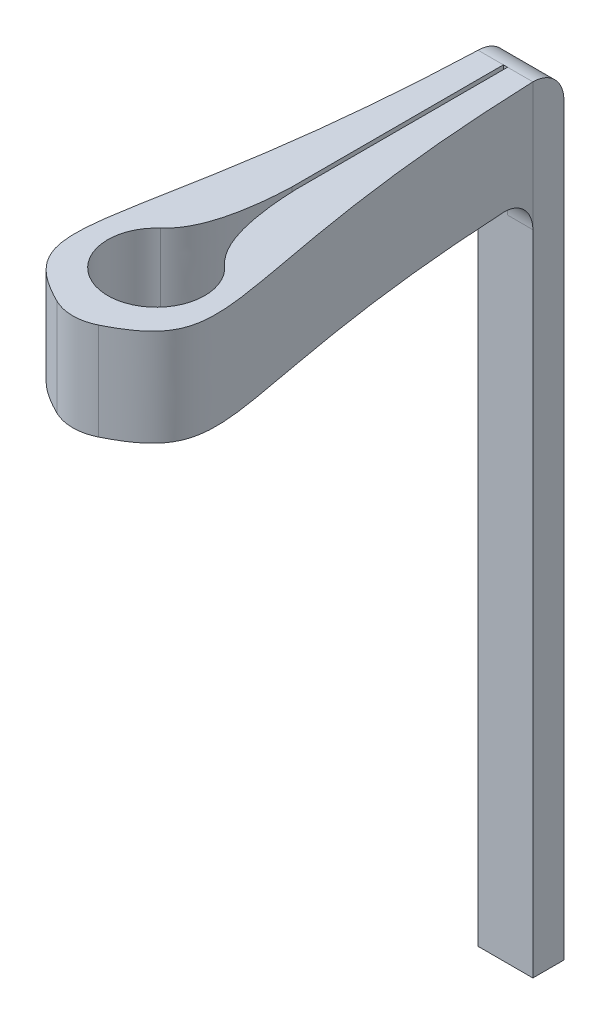
ISO-10303-21;
HEADER;
FILE_DESCRIPTION(('STEP AP214'),'2;1');
FILE_NAME('part.step','',(''),(''),'','','');
FILE_SCHEMA(('AUTOMOTIVE_DESIGN { 1 0 10303 214 1 1 1 1 }'));
ENDSEC;
DATA;
#1=APPLICATION_CONTEXT('core data for automotive mechanical design processes');
#2=APPLICATION_PROTOCOL_DEFINITION('international standard','automotive_design',2000,#1);
#3=PRODUCT_CONTEXT('',#1,'mechanical');
#4=PRODUCT('Part','Part','',(#3));
#5=PRODUCT_RELATED_PRODUCT_CATEGORY('part','',(#4));
#6=PRODUCT_DEFINITION_FORMATION('','',#4);
#7=PRODUCT_DEFINITION_CONTEXT('part definition',#1,'design');
#8=PRODUCT_DEFINITION('design','',#6,#7);
#9=PRODUCT_DEFINITION_SHAPE('','',#8);
#10=(LENGTH_UNIT() NAMED_UNIT(*) SI_UNIT(.MILLI.,.METRE.));
#11=(NAMED_UNIT(*) PLANE_ANGLE_UNIT() SI_UNIT($,.RADIAN.));
#12=(NAMED_UNIT(*) SI_UNIT($,.STERADIAN.) SOLID_ANGLE_UNIT());
#13=UNCERTAINTY_MEASURE_WITH_UNIT(LENGTH_MEASURE(1.E-05),#10,'distance_accuracy_value','');
#14=(GEOMETRIC_REPRESENTATION_CONTEXT(3) GLOBAL_UNCERTAINTY_ASSIGNED_CONTEXT((#13)) GLOBAL_UNIT_ASSIGNED_CONTEXT((#10,
#11,#12)) REPRESENTATION_CONTEXT('',''));
#15=CARTESIAN_POINT('',(0.,0.,0.));
#16=DIRECTION('',(0.,0.,1.));
#17=DIRECTION('',(1.,0.,0.));
#18=AXIS2_PLACEMENT_3D('',#15,#16,#17);
#19=CARTESIAN_POINT('',(0.895808533337032,-1.5875,-13.1387117385729));
#20=CARTESIAN_POINT('',(1.21007447279534,-1.5875,-4.57087153008787));
#21=CARTESIAN_POINT('',(2.7776087579068,-1.5875,-1.08356263840888));
#22=CARTESIAN_POINT('',(3.2771361570606,-1.5875,-0.201945645477048));
#23=CARTESIAN_POINT('',(0.,-1.5875,1.16995363792198));
#24=B_SPLINE_CURVE_WITH_KNOTS('',4,(#19,#20,#21,#22,#23),.UNSPECIFIED.,.F.,.F.,(5,5),(0.,1.),.UNSPECIFIED.);
#25=DIRECTION('',(0.,1.,0.));
#26=VECTOR('',#25,1.);
#27=SURFACE_OF_LINEAR_EXTRUSION('',#24,#26);
#28=CARTESIAN_POINT('',(0.895808533337032,1.5875,-13.1387117385729));
#29=CARTESIAN_POINT('',(1.21007447279534,1.5875,-4.57087153008787));
#30=CARTESIAN_POINT('',(2.7776087579068,1.5875,-1.08356263840888));
#31=CARTESIAN_POINT('',(3.2771361570606,1.5875,-0.201945645477048));
#32=CARTESIAN_POINT('',(0.,1.5875,1.16995363792198));
#33=B_SPLINE_CURVE_WITH_KNOTS('',4,(#28,#29,#30,#31,#32),.UNSPECIFIED.,.F.,.F.,(5,5),(0.,1.),.UNSPECIFIED.);
#34=CARTESIAN_POINT('',(0.895808533337032,1.5875,-13.1387117385729));
#35=VERTEX_POINT('',#34);
#36=CARTESIAN_POINT('',(0.677507544986384,1.5875,0.863468623555458));
#37=VERTEX_POINT('',#36);
#38=EDGE_CURVE('E182',#35,#37,#33,.T.);
#39=ORIENTED_EDGE('',*,*,#38,.T.);
#40=DIRECTION('',(0.,1.,0.));
#41=VECTOR('',#40,1.);
#42=CARTESIAN_POINT('',(0.677507544986435,1.5875,0.863468623555433));
#43=LINE('',#42,#41);
#44=CARTESIAN_POINT('',(0.677507544986384,-1.5875,0.863468623555458));
#45=VERTEX_POINT('',#44);
#46=EDGE_CURVE('E316',#37,#45,#43,.F.);
#47=ORIENTED_EDGE('',*,*,#46,.T.);
#48=CARTESIAN_POINT('',(0.940817771257643,-1.5875,-12.1227117385979));
#49=VERTEX_POINT('',#48);
#50=EDGE_CURVE('E220',#49,#45,#24,.T.);
#51=ORIENTED_EDGE('',*,*,#50,.F.);
#52=CARTESIAN_POINT('',(0.940817770777522,-1.5875,-12.1227117385729));
#53=CARTESIAN_POINT('',(0.939328600907444,-1.58750022204157,-12.1513079520232));
#54=CARTESIAN_POINT('',(0.93785946140498,-1.58870806349856,-12.1798915074532));
#55=CARTESIAN_POINT('',(0.934969141549042,-1.59352728075537,-12.2368564827357));
#56=CARTESIAN_POINT('',(0.933547959222119,-1.59713855752622,-12.2652379108677));
#57=CARTESIAN_POINT('',(0.929372489614877,-1.61154468895069,-12.3497267497475));
#58=CARTESIAN_POINT('',(0.926701444796436,-1.62591193266797,-12.4052717238406));
#59=CARTESIAN_POINT('',(0.921643753745075,-1.66377972410457,-12.51316937762));
#60=CARTESIAN_POINT('',(0.919257252531395,-1.68728490324401,-12.5655204229221));
#61=CARTESIAN_POINT('',(0.914807242295324,-1.74276538676793,-12.6655367231498));
#62=CARTESIAN_POINT('',(0.912743671302016,-1.77473906285321,-12.7132028764604));
#63=CARTESIAN_POINT('',(0.908964344849778,-1.84621844603389,-12.8024541281653));
#64=CARTESIAN_POINT('',(0.90724834479178,-1.88571881804383,-12.8440434972439));
#65=CARTESIAN_POINT('',(0.904172769237229,-1.97117878853448,-12.9200134206932));
#66=CARTESIAN_POINT('',(0.90281318548842,-2.01713823742763,-12.9543941419651));
#67=CARTESIAN_POINT('',(0.901044949174675,-2.08986741994529,-12.9997850900849));
#68=CARTESIAN_POINT('',(0.900500579509933,-2.11475181333681,-13.0138893566973));
#69=CARTESIAN_POINT('',(0.899501998730722,-2.16559629009388,-13.0399423328207));
#70=CARTESIAN_POINT('',(0.899047707887298,-2.19155539740104,-13.0518929476717));
#71=CARTESIAN_POINT('',(0.897819342422165,-2.27080393556553,-13.0843873593775));
#72=CARTESIAN_POINT('',(0.897178549331054,-2.32551572997143,-13.101605585224));
#73=CARTESIAN_POINT('',(0.896412642565198,-2.41771298811855,-13.1222827675783));
#74=CARTESIAN_POINT('',(0.896185875363191,-2.45462540078673,-13.1284396437794));
#75=CARTESIAN_POINT('',(0.895884062655519,-2.52885104385581,-13.136652425781));
#76=CARTESIAN_POINT('',(0.895808801597605,-2.56616362877481,-13.1387141578079));
#77=CARTESIAN_POINT('',(0.895808533337032,-2.6035,-13.1387117385729));
#78=B_SPLINE_CURVE_WITH_KNOTS('',3,(#52,#53,#54,#55,#56,#57,#58,#59,#60,#61,#62,#63,#64,#65,#66,
#67,#68,#69,#70,#71,#72,#73,#74,#75,#76,#77),.UNSPECIFIED.,.F.,.F.,(4,2,2,2,2,2,2,2,2,2,2,2,4),
(0.,0.0858522069243643,0.171700876690702,0.343122365469708,0.514630850066166,0.68610638139503,
0.857460816266934,1.02881128334724,1.11454841588172,1.20020932019451,1.37135254542086,
1.4834174901905,1.59532288386267),.UNSPECIFIED.);
#79=CARTESIAN_POINT('',(0.895808533337032,-2.6035,-13.1387117385729));
#80=VERTEX_POINT('',#79);
#81=EDGE_CURVE('E365',#49,#80,#78,.T.);
#82=ORIENTED_EDGE('',*,*,#81,.T.);
#83=DIRECTION('',(0.,1.,0.));
#84=VECTOR('',#83,1.);
#85=CARTESIAN_POINT('',(0.895808533337032,-1.5875,-13.1387117385729));
#86=LINE('',#85,#84);
#87=EDGE_CURVE('E56',#80,#35,#86,.T.);
#88=ORIENTED_EDGE('',*,*,#87,.T.);
#89=EDGE_LOOP('',(#39,#47,#51,#82,#88));
#90=FACE_BOUND('',#89,.T.);
#91=ADVANCED_FACE('F35',(#90),#27,.F.);
#92=CARTESIAN_POINT('',(-0.895808533337031,-1.5875,-13.1387117385729));
#93=CARTESIAN_POINT('',(-1.21007447279534,-1.5875,-4.57087153008787));
#94=CARTESIAN_POINT('',(-2.7776087579068,-1.5875,-1.08356263840888));
#95=CARTESIAN_POINT('',(-3.2771361570606,-1.5875,-0.201945645477048));
#96=CARTESIAN_POINT('',(0.,-1.5875,1.16995363792198));
#97=B_SPLINE_CURVE_WITH_KNOTS('',4,(#92,#93,#94,#95,#96),.UNSPECIFIED.,.F.,.F.,(5,5),(0.,1.),.UNSPECIFIED.);
#98=DIRECTION('',(0.,1.,0.));
#99=VECTOR('',#98,1.);
#100=SURFACE_OF_LINEAR_EXTRUSION('',#97,#99);
#101=DIRECTION('',(0.,1.,0.));
#102=VECTOR('',#101,1.);
#103=CARTESIAN_POINT('',(-0.895808533337031,-1.5875,-13.1387117385729));
#104=LINE('',#103,#102);
#105=CARTESIAN_POINT('',(-0.895808533337031,-2.6035,-13.1387117385729));
#106=VERTEX_POINT('',#105);
#107=CARTESIAN_POINT('',(-0.895808533337031,1.5875,-13.1387117385729));
#108=VERTEX_POINT('',#107);
#109=EDGE_CURVE('E339',#106,#108,#104,.T.);
#110=ORIENTED_EDGE('',*,*,#109,.F.);
#111=CARTESIAN_POINT('',(-0.895808533337031,-2.6035,-13.1387117385729));
#112=CARTESIAN_POINT('',(-0.895808644521803,-2.57493082215817,-13.138711544934));
#113=CARTESIAN_POINT('',(-0.895852749616112,-2.54637534498942,-13.1375059587632));
#114=CARTESIAN_POINT('',(-0.8960293760861,-2.48946876532865,-13.1326964350414));
#115=CARTESIAN_POINT('',(-0.896161893251777,-2.46111765317017,-13.1290926116894));
#116=CARTESIAN_POINT('',(-0.896692122889837,-2.37672593210134,-13.1147182255634));
#117=CARTESIAN_POINT('',(-0.897222511499748,-2.32125069622909,-13.1003846504929));
#118=CARTESIAN_POINT('',(-0.898639752593142,-2.21349767100376,-13.062615877911));
#119=CARTESIAN_POINT('',(-0.899526774793042,-2.1612214176636,-13.0391763471955));
#120=CARTESIAN_POINT('',(-0.901659536102315,-2.06134822821983,-12.9838637587255));
#121=CARTESIAN_POINT('',(-0.902905213284322,-2.01375048619993,-12.9519921569764));
#122=CARTESIAN_POINT('',(-0.905754096178373,-1.92457328936663,-12.8807197751934));
#123=CARTESIAN_POINT('',(-0.90735741181802,-1.88299569146331,-12.841316680733));
#124=CARTESIAN_POINT('',(-0.910914628002094,-1.8070333732752,-12.7560769076421));
#125=CARTESIAN_POINT('',(-0.912868525221261,-1.77264858477344,-12.7102402900345));
#126=CARTESIAN_POINT('',(-0.916046154230379,-1.72720747571318,-12.6376748721264));
#127=CARTESIAN_POINT('',(-0.917147881131955,-1.71307061112935,-12.612821033248));
#128=CARTESIAN_POINT('',(-0.91942893394455,-1.68695104376555,-12.5620395102616));
#129=CARTESIAN_POINT('',(-0.920608189875637,-1.67496643379838,-12.536112802183));
#130=CARTESIAN_POINT('',(-0.924257339092153,-1.64236563386945,-12.4569627280144));
#131=CARTESIAN_POINT('',(-0.926840763556043,-1.62507157727108,-12.4023199715406));
#132=CARTESIAN_POINT('',(-0.931331467141856,-1.60418275921374,-12.3099181168085));
#133=CARTESIAN_POINT('',(-0.933170568992069,-1.59793047249544,-12.2727244503796));
#134=CARTESIAN_POINT('',(-0.936934076125651,-1.58959077551676,-12.1979312915133));
#135=CARTESIAN_POINT('',(-0.938858355772612,-1.58749742722677,-12.1603324548522));
#136=CARTESIAN_POINT('',(-0.94081777125773,-1.5875,-12.1227117385963));
#137=B_SPLINE_CURVE_WITH_KNOTS('',3,(#111,#112,#113,#114,#115,#116,#117,#118,#119,#120,#121,
#122,#123,#124,#125,#126,#127,#128,#129,#130,#131,#132,#133,#134,#135,#136),.UNSPECIFIED.,.F.,
.F.,(4,2,2,2,2,2,2,2,2,2,2,2,4),(0.,0.0856548572810295,0.171305636144386,0.34232214208756,
0.513420128655629,0.684488590190824,0.855609705801621,1.02672919841746,1.11248320510674,
1.19816084316029,1.36934325509694,1.48241519898036,1.59532558518064),.UNSPECIFIED.);
#138=CARTESIAN_POINT('',(-0.940817771257643,-1.5875,-12.1227117385979));
#139=VERTEX_POINT('',#138);
#140=EDGE_CURVE('E11',#106,#139,#137,.T.);
#141=ORIENTED_EDGE('',*,*,#140,.T.);
#142=CARTESIAN_POINT('',(-0.677507544986381,-1.5875,0.863468623555459));
#143=VERTEX_POINT('',#142);
#144=EDGE_CURVE('E243',#139,#143,#97,.T.);
#145=ORIENTED_EDGE('',*,*,#144,.T.);
#146=DIRECTION('',(0.,1.,0.));
#147=VECTOR('',#146,1.);
#148=CARTESIAN_POINT('',(-0.677507544986433,-1.5875,0.863468623555434));
#149=LINE('',#148,#147);
#150=CARTESIAN_POINT('',(-0.677507544986381,1.5875,0.863468623555459));
#151=VERTEX_POINT('',#150);
#152=EDGE_CURVE('E331',#143,#151,#149,.T.);
#153=ORIENTED_EDGE('',*,*,#152,.T.);
#154=CARTESIAN_POINT('',(-0.895808533337031,1.5875,-13.1387117385729));
#155=CARTESIAN_POINT('',(-1.21007447279534,1.5875,-4.57087153008787));
#156=CARTESIAN_POINT('',(-2.7776087579068,1.5875,-1.08356263840888));
#157=CARTESIAN_POINT('',(-3.2771361570606,1.5875,-0.201945645477048));
#158=CARTESIAN_POINT('',(0.,1.5875,1.16995363792198));
#159=B_SPLINE_CURVE_WITH_KNOTS('',4,(#154,#155,#156,#157,#158),.UNSPECIFIED.,.F.,.F.,(5,5),(0.,
1.),.UNSPECIFIED.);
#160=EDGE_CURVE('E215',#108,#151,#159,.T.);
#161=ORIENTED_EDGE('',*,*,#160,.F.);
#162=EDGE_LOOP('',(#110,#141,#145,#153,#161));
#163=FACE_BOUND('',#162,.T.);
#164=ADVANCED_FACE('F261',(#163),#100,.T.);
#165=CARTESIAN_POINT('',(-0.0682967636124147,-1.5875,0.));
#166=DIRECTION('',(-1.,0.,0.));
#167=DIRECTION('',(0.,0.,1.));
#168=AXIS2_PLACEMENT_3D('',#165,#166,#167);
#169=PLANE('',#168);
#170=DIRECTION('',(0.,1.,0.));
#171=VECTOR('',#170,1.);
#172=CARTESIAN_POINT('',(-0.0682967636124164,-1.5875,-13.1387117385729));
#173=LINE('',#172,#171);
#174=CARTESIAN_POINT('',(-0.0682967636124164,-2.6035,-13.1387117385729));
#175=VERTEX_POINT('',#174);
#176=CARTESIAN_POINT('',(-0.0682967636124159,1.5875,-13.1387117385729));
#177=VERTEX_POINT('',#176);
#178=EDGE_CURVE('E255',#175,#177,#173,.T.);
#179=ORIENTED_EDGE('',*,*,#178,.T.);
#180=DIRECTION('',(0.,0.,1.));
#181=VECTOR('',#180,1.);
#182=CARTESIAN_POINT('',(-0.0682967636124147,1.5875,0.));
#183=LINE('',#182,#181);
#184=CARTESIAN_POINT('',(-0.0682967636124155,1.5875,-6.21461869480893));
#185=VERTEX_POINT('',#184);
#186=EDGE_CURVE('E209',#177,#185,#183,.T.);
#187=ORIENTED_EDGE('',*,*,#186,.T.);
#188=DIRECTION('',(0.,1.,0.));
#189=VECTOR('',#188,1.);
#190=CARTESIAN_POINT('',(-0.0682967636124155,-1.5875,-6.21461869480893));
#191=LINE('',#190,#189);
#192=CARTESIAN_POINT('',(-0.0682967636124155,-1.5875,-6.21461869480893));
#193=VERTEX_POINT('',#192);
#194=EDGE_CURVE('E392',#193,#185,#191,.T.);
#195=ORIENTED_EDGE('',*,*,#194,.F.);
#196=DIRECTION('',(0.,0.,1.));
#197=VECTOR('',#196,1.);
#198=CARTESIAN_POINT('',(-0.0682967636124147,-1.5875,0.));
#199=LINE('',#198,#197);
#200=CARTESIAN_POINT('',(-0.0682967636124162,-1.5875,-12.1227117385729));
#201=VERTEX_POINT('',#200);
#202=EDGE_CURVE('E246',#201,#193,#199,.T.);
#203=ORIENTED_EDGE('',*,*,#202,.F.);
#204=CARTESIAN_POINT('',(-0.0682967636124162,-2.6035,-12.1227117385729));
#205=DIRECTION('',(-1.,0.,0.));
#206=DIRECTION('',(0.,0.,1.));
#207=AXIS2_PLACEMENT_3D('',#204,#205,#206);
#208=CIRCLE('',#207,1.016);
#209=EDGE_CURVE('E49',#201,#175,#208,.T.);
#210=ORIENTED_EDGE('',*,*,#209,.T.);
#211=EDGE_LOOP('',(#179,#187,#195,#203,#210));
#212=FACE_BOUND('',#211,.T.);
#213=ADVANCED_FACE('F266',(#212),#169,.F.);
#214=CARTESIAN_POINT('',(-1.05409896108141,-1.5875,-2.89573812001823));
#215=CARTESIAN_POINT('',(-0.161537853761285,-1.5875,-3.68834707179423));
#216=CARTESIAN_POINT('',(-0.0682967636124155,-1.5875,-6.21461869480893));
#217=B_SPLINE_CURVE_WITH_KNOTS('',2,(#214,#215,#216),.UNSPECIFIED.,.F.,.F.,(3,3),(0.,1.),.UNSPECIFIED.);
#218=DIRECTION('',(0.,1.,0.));
#219=VECTOR('',#218,1.);
#220=SURFACE_OF_LINEAR_EXTRUSION('',#217,#219);
#221=ORIENTED_EDGE('',*,*,#194,.T.);
#222=CARTESIAN_POINT('',(-1.05409896108141,1.5875,-2.89573812001823));
#223=CARTESIAN_POINT('',(-0.161537853761285,1.5875,-3.68834707179423));
#224=CARTESIAN_POINT('',(-0.0682967636124155,1.5875,-6.21461869480893));
#225=B_SPLINE_CURVE_WITH_KNOTS('',2,(#222,#223,#224),.UNSPECIFIED.,.F.,.F.,(3,3),(0.,1.),.UNSPECIFIED.);
#226=CARTESIAN_POINT('',(-1.05409896108141,1.5875,-2.89573812001823));
#227=VERTEX_POINT('',#226);
#228=EDGE_CURVE('E204',#227,#185,#225,.T.);
#229=ORIENTED_EDGE('',*,*,#228,.F.);
#230=DIRECTION('',(0.,1.,0.));
#231=VECTOR('',#230,1.);
#232=CARTESIAN_POINT('',(-1.05409896108141,-1.5875,-2.89573812001823));
#233=LINE('',#232,#231);
#234=CARTESIAN_POINT('',(-1.05409896108141,-1.5875,-2.89573812001823));
#235=VERTEX_POINT('',#234);
#236=EDGE_CURVE('E391',#235,#227,#233,.T.);
#237=ORIENTED_EDGE('',*,*,#236,.F.);
#238=EDGE_CURVE('E279',#235,#193,#217,.T.);
#239=ORIENTED_EDGE('',*,*,#238,.T.);
#240=EDGE_LOOP('',(#221,#229,#237,#239));
#241=FACE_BOUND('',#240,.T.);
#242=ADVANCED_FACE('F272',(#241),#220,.T.);
#243=CARTESIAN_POINT('',(0.,-1.5875,-1.70871173857294));
#244=DIRECTION('',(0.,1.,0.));
#245=DIRECTION('',(0.,0.,1.));
#246=AXIS2_PLACEMENT_3D('',#243,#244,#245);
#247=CYLINDRICAL_SURFACE('',#246,1.5875);
#248=ORIENTED_EDGE('',*,*,#236,.T.);
#249=CARTESIAN_POINT('',(0.,1.5875,-1.70871173857294));
#250=DIRECTION('',(0.,1.,0.));
#251=DIRECTION('',(0.,0.,1.));
#252=AXIS2_PLACEMENT_3D('',#249,#250,#251);
#253=CIRCLE('',#252,1.5875);
#254=CARTESIAN_POINT('',(1.05409896108141,1.5875,-2.89573812001823));
#255=VERTEX_POINT('',#254);
#256=EDGE_CURVE('E198',#227,#255,#253,.T.);
#257=ORIENTED_EDGE('',*,*,#256,.T.);
#258=DIRECTION('',(0.,1.,0.));
#259=VECTOR('',#258,1.);
#260=CARTESIAN_POINT('',(1.05409896108141,-1.5875,-2.89573812001823));
#261=LINE('',#260,#259);
#262=CARTESIAN_POINT('',(1.05409896108141,-1.5875,-2.89573812001823));
#263=VERTEX_POINT('',#262);
#264=EDGE_CURVE('E389',#263,#255,#261,.T.);
#265=ORIENTED_EDGE('',*,*,#264,.F.);
#266=CARTESIAN_POINT('',(0.,-1.5875,-1.70871173857294));
#267=DIRECTION('',(0.,1.,0.));
#268=DIRECTION('',(0.,0.,1.));
#269=AXIS2_PLACEMENT_3D('',#266,#267,#268);
#270=CIRCLE('',#269,1.5875);
#271=EDGE_CURVE('E285',#235,#263,#270,.T.);
#272=ORIENTED_EDGE('',*,*,#271,.F.);
#273=EDGE_LOOP('',(#248,#257,#265,#272));
#274=FACE_BOUND('',#273,.T.);
#275=ADVANCED_FACE('F276',(#274),#247,.F.);
#276=CARTESIAN_POINT('',(1.05409896108141,-1.5875,-2.89573812001823));
#277=CARTESIAN_POINT('',(0.161537853761285,-1.5875,-3.68834707179423));
#278=CARTESIAN_POINT('',(0.0682967636124155,-1.5875,-6.21461869480893));
#279=B_SPLINE_CURVE_WITH_KNOTS('',2,(#276,#277,#278),.UNSPECIFIED.,.F.,.F.,(3,3),(0.,1.),.UNSPECIFIED.);
#280=DIRECTION('',(0.,1.,0.));
#281=VECTOR('',#280,1.);
#282=SURFACE_OF_LINEAR_EXTRUSION('',#279,#281);
#283=ORIENTED_EDGE('',*,*,#264,.T.);
#284=CARTESIAN_POINT('',(1.05409896108141,1.5875,-2.89573812001823));
#285=CARTESIAN_POINT('',(0.161537853761285,1.5875,-3.68834707179423));
#286=CARTESIAN_POINT('',(0.0682967636124155,1.5875,-6.21461869480893));
#287=B_SPLINE_CURVE_WITH_KNOTS('',2,(#284,#285,#286),.UNSPECIFIED.,.F.,.F.,(3,3),(0.,1.),.UNSPECIFIED.);
#288=CARTESIAN_POINT('',(0.0682967636124155,1.5875,-6.21461869480893));
#289=VERTEX_POINT('',#288);
#290=EDGE_CURVE('E193',#255,#289,#287,.T.);
#291=ORIENTED_EDGE('',*,*,#290,.T.);
#292=DIRECTION('',(0.,1.,0.));
#293=VECTOR('',#292,1.);
#294=CARTESIAN_POINT('',(0.0682967636124155,-1.5875,-6.21461869480893));
#295=LINE('',#294,#293);
#296=CARTESIAN_POINT('',(0.0682967636124155,-1.5875,-6.21461869480893));
#297=VERTEX_POINT('',#296);
#298=EDGE_CURVE('E387',#297,#289,#295,.T.);
#299=ORIENTED_EDGE('',*,*,#298,.F.);
#300=EDGE_CURVE('E289',#263,#297,#279,.T.);
#301=ORIENTED_EDGE('',*,*,#300,.F.);
#302=EDGE_LOOP('',(#283,#291,#299,#301));
#303=FACE_BOUND('',#302,.T.);
#304=ADVANCED_FACE('F297',(#303),#282,.F.);
#305=CARTESIAN_POINT('',(0.0682967636124147,-1.5875,0.));
#306=DIRECTION('',(-1.,0.,0.));
#307=DIRECTION('',(0.,0.,1.));
#308=AXIS2_PLACEMENT_3D('',#305,#306,#307);
#309=PLANE('',#308);
#310=ORIENTED_EDGE('',*,*,#298,.T.);
#311=DIRECTION('',(0.,0.,1.));
#312=VECTOR('',#311,1.);
#313=CARTESIAN_POINT('',(0.0682967636124147,1.5875,0.));
#314=LINE('',#313,#312);
#315=CARTESIAN_POINT('',(0.0682967636124164,1.5875,-13.1387117385729));
#316=VERTEX_POINT('',#315);
#317=EDGE_CURVE('E187',#316,#289,#314,.T.);
#318=ORIENTED_EDGE('',*,*,#317,.F.);
#319=DIRECTION('',(0.,1.,0.));
#320=VECTOR('',#319,1.);
#321=CARTESIAN_POINT('',(0.0682967636124164,-1.5875,-13.1387117385729));
#322=LINE('',#321,#320);
#323=CARTESIAN_POINT('',(0.0682967636124164,-2.6035,-13.1387117385729));
#324=VERTEX_POINT('',#323);
#325=EDGE_CURVE('E336',#324,#316,#322,.T.);
#326=ORIENTED_EDGE('',*,*,#325,.F.);
#327=CARTESIAN_POINT('',(0.0682967636124163,-2.6035,-12.1227117385729));
#328=DIRECTION('',(-1.,0.,0.));
#329=DIRECTION('',(0.,0.,1.));
#330=AXIS2_PLACEMENT_3D('',#327,#328,#329);
#331=CIRCLE('',#330,1.016);
#332=CARTESIAN_POINT('',(0.0682967636124162,-1.5875,-12.1227117385729));
#333=VERTEX_POINT('',#332);
#334=EDGE_CURVE('E363',#324,#333,#331,.F.);
#335=ORIENTED_EDGE('',*,*,#334,.T.);
#336=DIRECTION('',(0.,0.,1.));
#337=VECTOR('',#336,1.);
#338=CARTESIAN_POINT('',(0.0682967636124147,-1.5875,0.));
#339=LINE('',#338,#337);
#340=EDGE_CURVE('E228',#333,#297,#339,.T.);
#341=ORIENTED_EDGE('',*,*,#340,.T.);
#342=EDGE_LOOP('',(#310,#318,#326,#335,#341));
#343=FACE_BOUND('',#342,.T.);
#344=ADVANCED_FACE('F299',(#343),#309,.T.);
#345=CARTESIAN_POINT('',(0.,-1.5875,0.));
#346=DIRECTION('',(0.,1.,0.));
#347=DIRECTION('',(0.,0.,1.));
#348=AXIS2_PLACEMENT_3D('',#345,#346,#347);
#349=PLANE('',#348);
#350=ORIENTED_EDGE('',*,*,#340,.F.);
#351=DIRECTION('',(-1.,0.,0.));
#352=VECTOR('',#351,1.);
#353=CARTESIAN_POINT('',(0.,-1.5875,-12.1227117385729));
#354=LINE('',#353,#352);
#355=EDGE_CURVE('E346',#333,#49,#354,.F.);
#356=ORIENTED_EDGE('',*,*,#355,.T.);
#357=ORIENTED_EDGE('',*,*,#50,.T.);
#358=CARTESIAN_POINT('',(0.,-1.5875,-0.501653908119454));
#359=DIRECTION('',(0.,1.,0.));
#360=DIRECTION('',(0.,0.,1.));
#361=AXIS2_PLACEMENT_3D('',#358,#359,#360);
#362=CIRCLE('',#361,1.524);
#363=EDGE_CURVE('E328',#45,#143,#362,.F.);
#364=ORIENTED_EDGE('',*,*,#363,.T.);
#365=ORIENTED_EDGE('',*,*,#144,.F.);
#366=DIRECTION('',(1.,0.,0.));
#367=VECTOR('',#366,1.);
#368=CARTESIAN_POINT('',(0.,-1.5875,-12.1227117385729));
#369=LINE('',#368,#367);
#370=EDGE_CURVE('E247',#139,#201,#369,.T.);
#371=ORIENTED_EDGE('',*,*,#370,.T.);
#372=ORIENTED_EDGE('',*,*,#202,.T.);
#373=ORIENTED_EDGE('',*,*,#238,.F.);
#374=ORIENTED_EDGE('',*,*,#271,.T.);
#375=ORIENTED_EDGE('',*,*,#300,.T.);
#376=EDGE_LOOP('',(#350,#356,#357,#364,#365,#371,#372,#373,#374,#375));
#377=FACE_BOUND('',#376,.T.);
#378=ADVANCED_FACE('F268',(#377),#349,.F.);
#379=CARTESIAN_POINT('',(0.,1.5875,0.));
#380=DIRECTION('',(0.,1.,0.));
#381=DIRECTION('',(0.,0.,1.));
#382=AXIS2_PLACEMENT_3D('',#379,#380,#381);
#383=PLANE('',#382);
#384=ORIENTED_EDGE('',*,*,#38,.F.);
#385=DIRECTION('',(-1.,0.,0.));
#386=VECTOR('',#385,1.);
#387=CARTESIAN_POINT('',(0.,1.5875,-13.1387117385729));
#388=LINE('',#387,#386);
#389=EDGE_CURVE('E353',#35,#316,#388,.T.);
#390=ORIENTED_EDGE('',*,*,#389,.T.);
#391=ORIENTED_EDGE('',*,*,#317,.T.);
#392=ORIENTED_EDGE('',*,*,#290,.F.);
#393=ORIENTED_EDGE('',*,*,#256,.F.);
#394=ORIENTED_EDGE('',*,*,#228,.T.);
#395=ORIENTED_EDGE('',*,*,#186,.F.);
#396=DIRECTION('',(-1.,0.,0.));
#397=VECTOR('',#396,1.);
#398=CARTESIAN_POINT('',(0.,1.5875,-13.1387117385729));
#399=LINE('',#398,#397);
#400=EDGE_CURVE('E350',#177,#108,#399,.T.);
#401=ORIENTED_EDGE('',*,*,#400,.T.);
#402=ORIENTED_EDGE('',*,*,#160,.T.);
#403=CARTESIAN_POINT('',(0.,1.5875,-0.501653908119454));
#404=DIRECTION('',(0.,1.,0.));
#405=DIRECTION('',(0.,0.,1.));
#406=AXIS2_PLACEMENT_3D('',#403,#404,#405);
#407=CIRCLE('',#406,1.524);
#408=EDGE_CURVE('E325',#151,#37,#407,.T.);
#409=ORIENTED_EDGE('',*,*,#408,.T.);
#410=EDGE_LOOP('',(#384,#390,#391,#392,#393,#394,#395,#401,#402,#409));
#411=FACE_BOUND('',#410,.T.);
#412=ADVANCED_FACE('F306',(#411),#383,.T.);
#413=CARTESIAN_POINT('',(0.,0.,-0.501653908119454));
#414=DIRECTION('',(0.,1.,0.));
#415=DIRECTION('',(0.,0.,1.));
#416=AXIS2_PLACEMENT_3D('',#413,#414,#415);
#417=CYLINDRICAL_SURFACE('',#416,1.524);
#418=ORIENTED_EDGE('',*,*,#363,.F.);
#419=ORIENTED_EDGE('',*,*,#46,.F.);
#420=ORIENTED_EDGE('',*,*,#408,.F.);
#421=ORIENTED_EDGE('',*,*,#152,.F.);
#422=EDGE_LOOP('',(#418,#419,#420,#421));
#423=FACE_BOUND('',#422,.T.);
#424=ADVANCED_FACE('F323',(#423),#417,.T.);
#425=CARTESIAN_POINT('',(0.895808533337032,0.,-13.1387117385729));
#426=DIRECTION('',(0.,0.,1.));
#427=DIRECTION('',(1.,0.,0.));
#428=AXIS2_PLACEMENT_3D('',#425,#426,#427);
#429=PLANE('',#428);
#430=DIRECTION('',(0.,1.,0.));
#431=VECTOR('',#430,1.);
#432=CARTESIAN_POINT('',(0.895808533337032,0.,-13.1387117385729));
#433=LINE('',#432,#431);
#434=CARTESIAN_POINT('',(0.895808533337032,-23.8125,-13.1387117385729));
#435=VERTEX_POINT('',#434);
#436=EDGE_CURVE('E170',#435,#80,#433,.T.);
#437=ORIENTED_EDGE('',*,*,#436,.T.);
#438=DIRECTION('',(-1.,0.,0.));
#439=VECTOR('',#438,1.);
#440=CARTESIAN_POINT('',(0.895808533337032,-2.6035,-13.1387117385729));
#441=LINE('',#440,#439);
#442=EDGE_CURVE('E241',#80,#324,#441,.T.);
#443=ORIENTED_EDGE('',*,*,#442,.T.);
#444=ORIENTED_EDGE('',*,*,#325,.T.);
#445=DIRECTION('',(-1.,0.,0.));
#446=VECTOR('',#445,1.);
#447=CARTESIAN_POINT('',(0.895808533337032,1.5875,-13.1387117385729));
#448=LINE('',#447,#446);
#449=EDGE_CURVE('E151',#316,#177,#448,.T.);
#450=ORIENTED_EDGE('',*,*,#449,.T.);
#451=ORIENTED_EDGE('',*,*,#178,.F.);
#452=DIRECTION('',(1.,0.,0.));
#453=VECTOR('',#452,1.);
#454=CARTESIAN_POINT('',(0.895808533337032,-2.6035,-13.1387117385729));
#455=LINE('',#454,#453);
#456=EDGE_CURVE('E159',#175,#106,#455,.F.);
#457=ORIENTED_EDGE('',*,*,#456,.T.);
#458=DIRECTION('',(0.,1.,0.));
#459=VECTOR('',#458,1.);
#460=CARTESIAN_POINT('',(-0.895808533337031,0.,-13.1387117385729));
#461=LINE('',#460,#459);
#462=CARTESIAN_POINT('',(-0.895808533337031,-23.8125,-13.1387117385729));
#463=VERTEX_POINT('',#462);
#464=EDGE_CURVE('E156',#463,#106,#461,.T.);
#465=ORIENTED_EDGE('',*,*,#464,.F.);
#466=DIRECTION('',(-1.,0.,0.));
#467=VECTOR('',#466,1.);
#468=CARTESIAN_POINT('',(0.895808533337032,-23.8125,-13.1387117385729));
#469=LINE('',#468,#467);
#470=EDGE_CURVE('E142',#435,#463,#469,.T.);
#471=ORIENTED_EDGE('',*,*,#470,.F.);
#472=EDGE_LOOP('',(#437,#443,#444,#450,#451,#457,#465,#471));
#473=FACE_BOUND('',#472,.T.);
#474=ADVANCED_FACE('F157',(#473),#429,.T.);
#475=CARTESIAN_POINT('',(0.895808533337032,0.,-14.1547117385729));
#476=DIRECTION('',(0.,0.,-1.));
#477=DIRECTION('',(0.,1.,0.));
#478=AXIS2_PLACEMENT_3D('',#475,#476,#477);
#479=PLANE('',#478);
#480=DIRECTION('',(0.,-1.,0.));
#481=VECTOR('',#480,1.);
#482=CARTESIAN_POINT('',(-0.895808533337031,0.,-14.1547117385729));
#483=LINE('',#482,#481);
#484=CARTESIAN_POINT('',(-0.895808533337031,0.5715,-14.1547117385729));
#485=VERTEX_POINT('',#484);
#486=CARTESIAN_POINT('',(-0.895808533337031,-23.8125,-14.1547117385729));
#487=VERTEX_POINT('',#486);
#488=EDGE_CURVE('E163',#485,#487,#483,.T.);
#489=ORIENTED_EDGE('',*,*,#488,.F.);
#490=DIRECTION('',(-1.,0.,0.));
#491=VECTOR('',#490,1.);
#492=CARTESIAN_POINT('',(0.895808533337032,0.5715,-14.1547117385729));
#493=LINE('',#492,#491);
#494=CARTESIAN_POINT('',(0.895808533337032,0.5715,-14.1547117385729));
#495=VERTEX_POINT('',#494);
#496=EDGE_CURVE('E359',#485,#495,#493,.F.);
#497=ORIENTED_EDGE('',*,*,#496,.T.);
#498=DIRECTION('',(0.,-1.,0.));
#499=VECTOR('',#498,1.);
#500=CARTESIAN_POINT('',(0.895808533337032,0.,-14.1547117385729));
#501=LINE('',#500,#499);
#502=CARTESIAN_POINT('',(0.895808533337032,-23.8125,-14.1547117385729));
#503=VERTEX_POINT('',#502);
#504=EDGE_CURVE('E168',#495,#503,#501,.T.);
#505=ORIENTED_EDGE('',*,*,#504,.T.);
#506=DIRECTION('',(-1.,0.,0.));
#507=VECTOR('',#506,1.);
#508=CARTESIAN_POINT('',(0.895808533337032,-23.8125,-14.1547117385729));
#509=LINE('',#508,#507);
#510=EDGE_CURVE('E152',#503,#487,#509,.T.);
#511=ORIENTED_EDGE('',*,*,#510,.T.);
#512=EDGE_LOOP('',(#489,#497,#505,#511));
#513=FACE_BOUND('',#512,.T.);
#514=ADVANCED_FACE('F404',(#513),#479,.T.);
#515=CARTESIAN_POINT('',(0.895808533337032,-23.8125,0.));
#516=DIRECTION('',(0.,1.,0.));
#517=DIRECTION('',(0.,0.,1.));
#518=AXIS2_PLACEMENT_3D('',#515,#516,#517);
#519=PLANE('',#518);
#520=ORIENTED_EDGE('',*,*,#470,.T.);
#521=DIRECTION('',(0.,0.,-1.));
#522=VECTOR('',#521,1.);
#523=CARTESIAN_POINT('',(-0.895808533337031,-23.8125,0.));
#524=LINE('',#523,#522);
#525=EDGE_CURVE('E147',#463,#487,#524,.T.);
#526=ORIENTED_EDGE('',*,*,#525,.T.);
#527=ORIENTED_EDGE('',*,*,#510,.F.);
#528=DIRECTION('',(0.,0.,-1.));
#529=VECTOR('',#528,1.);
#530=CARTESIAN_POINT('',(0.895808533337032,-23.8125,0.));
#531=LINE('',#530,#529);
#532=EDGE_CURVE('E149',#435,#503,#531,.T.);
#533=ORIENTED_EDGE('',*,*,#532,.F.);
#534=EDGE_LOOP('',(#520,#526,#527,#533));
#535=FACE_BOUND('',#534,.T.);
#536=ADVANCED_FACE('F144',(#535),#519,.F.);
#537=CARTESIAN_POINT('',(0.895808533337032,0.,0.));
#538=DIRECTION('',(1.,0.,0.));
#539=DIRECTION('',(0.,0.,-1.));
#540=AXIS2_PLACEMENT_3D('',#537,#538,#539);
#541=PLANE('',#540);
#542=ORIENTED_EDGE('',*,*,#504,.F.);
#543=CARTESIAN_POINT('',(0.895808533337032,0.5715,-13.1387117385729));
#544=DIRECTION('',(1.,0.,0.));
#545=DIRECTION('',(0.,0.,-1.));
#546=AXIS2_PLACEMENT_3D('',#543,#544,#545);
#547=CIRCLE('',#546,1.016);
#548=EDGE_CURVE('E361',#495,#35,#547,.T.);
#549=ORIENTED_EDGE('',*,*,#548,.T.);
#550=ORIENTED_EDGE('',*,*,#87,.F.);
#551=ORIENTED_EDGE('',*,*,#436,.F.);
#552=ORIENTED_EDGE('',*,*,#532,.T.);
#553=EDGE_LOOP('',(#542,#549,#550,#551,#552));
#554=FACE_BOUND('',#553,.T.);
#555=ADVANCED_FACE('F406',(#554),#541,.T.);
#556=CARTESIAN_POINT('',(-0.895808533337031,0.,0.));
#557=DIRECTION('',(1.,0.,0.));
#558=DIRECTION('',(0.,0.,-1.));
#559=AXIS2_PLACEMENT_3D('',#556,#557,#558);
#560=PLANE('',#559);
#561=ORIENTED_EDGE('',*,*,#109,.T.);
#562=CARTESIAN_POINT('',(-0.895808533337031,0.5715,-13.1387117385729));
#563=DIRECTION('',(1.,0.,0.));
#564=DIRECTION('',(0.,0.,-1.));
#565=AXIS2_PLACEMENT_3D('',#562,#563,#564);
#566=CIRCLE('',#565,1.016);
#567=EDGE_CURVE('E357',#108,#485,#566,.F.);
#568=ORIENTED_EDGE('',*,*,#567,.T.);
#569=ORIENTED_EDGE('',*,*,#488,.T.);
#570=ORIENTED_EDGE('',*,*,#525,.F.);
#571=ORIENTED_EDGE('',*,*,#464,.T.);
#572=EDGE_LOOP('',(#561,#568,#569,#570,#571));
#573=FACE_BOUND('',#572,.T.);
#574=ADVANCED_FACE('F165',(#573),#560,.F.);
#575=CARTESIAN_POINT('',(0.895808533337032,-2.6035,-12.1227117385729));
#576=DIRECTION('',(-1.,0.,0.));
#577=DIRECTION('',(0.,0.,1.));
#578=AXIS2_PLACEMENT_3D('',#575,#576,#577);
#579=CYLINDRICAL_SURFACE('',#578,1.016);
#580=ORIENTED_EDGE('',*,*,#81,.F.);
#581=ORIENTED_EDGE('',*,*,#355,.F.);
#582=ORIENTED_EDGE('',*,*,#334,.F.);
#583=ORIENTED_EDGE('',*,*,#442,.F.);
#584=EDGE_LOOP('',(#580,#581,#582,#583));
#585=FACE_BOUND('',#584,.T.);
#586=ADVANCED_FACE('F371',(#585),#579,.F.);
#587=CARTESIAN_POINT('',(0.,-2.6035,-12.1227117385729));
#588=DIRECTION('',(1.,0.,0.));
#589=DIRECTION('',(0.,0.,-1.));
#590=AXIS2_PLACEMENT_3D('',#587,#588,#589);
#591=CYLINDRICAL_SURFACE('',#590,1.016);
#592=ORIENTED_EDGE('',*,*,#140,.F.);
#593=ORIENTED_EDGE('',*,*,#456,.F.);
#594=ORIENTED_EDGE('',*,*,#209,.F.);
#595=ORIENTED_EDGE('',*,*,#370,.F.);
#596=EDGE_LOOP('',(#592,#593,#594,#595));
#597=FACE_BOUND('',#596,.T.);
#598=ADVANCED_FACE('F374',(#597),#591,.F.);
#599=CARTESIAN_POINT('',(0.,0.5715,-13.1387117385729));
#600=DIRECTION('',(-1.,0.,0.));
#601=DIRECTION('',(0.,0.,1.));
#602=AXIS2_PLACEMENT_3D('',#599,#600,#601);
#603=CYLINDRICAL_SURFACE('',#602,1.016);
#604=ORIENTED_EDGE('',*,*,#548,.F.);
#605=ORIENTED_EDGE('',*,*,#496,.F.);
#606=ORIENTED_EDGE('',*,*,#567,.F.);
#607=ORIENTED_EDGE('',*,*,#400,.F.);
#608=ORIENTED_EDGE('',*,*,#449,.F.);
#609=ORIENTED_EDGE('',*,*,#389,.F.);
#610=EDGE_LOOP('',(#604,#605,#606,#607,#608,#609));
#611=FACE_BOUND('',#610,.T.);
#612=ADVANCED_FACE('F37',(#611),#603,.T.);
#613=CLOSED_SHELL('',(#91,#164,#213,#242,#275,#304,#344,#378,#412,#424,#474,#514,#536,#555,#574,
#586,#598,#612));
#614=MANIFOLD_SOLID_BREP('B2',#613);
#615=ADVANCED_BREP_SHAPE_REPRESENTATION('',(#18,#614),#14);
#616=SHAPE_DEFINITION_REPRESENTATION(#9,#615);
ENDSEC;
END-ISO-10303-21;
